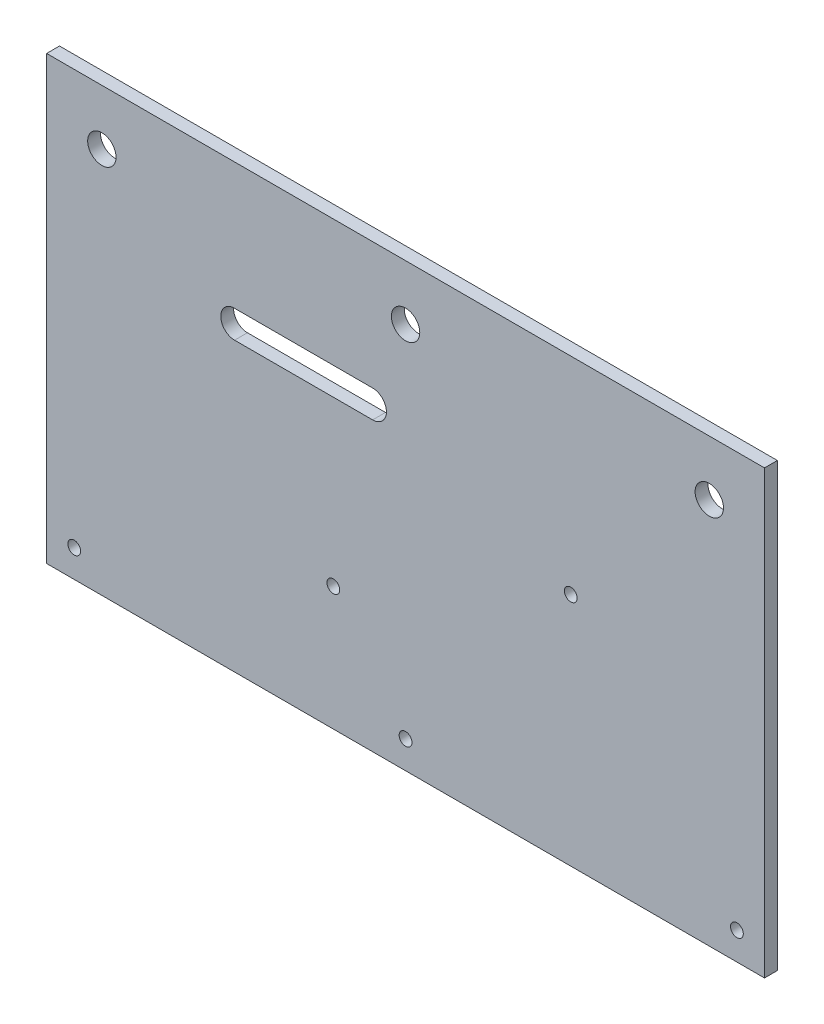
ISO-10303-21;
HEADER;
FILE_DESCRIPTION(('STEP AP214'),'2;1');
FILE_NAME('part.step','',(''),(''),'','','');
FILE_SCHEMA(('AUTOMOTIVE_DESIGN { 1 0 10303 214 1 1 1 1 }'));
ENDSEC;
DATA;
#1=APPLICATION_CONTEXT('core data for automotive mechanical design processes');
#2=APPLICATION_PROTOCOL_DEFINITION('international standard','automotive_design',2000,#1);
#3=PRODUCT_CONTEXT('',#1,'mechanical');
#4=PRODUCT('Part','Part','',(#3));
#5=PRODUCT_RELATED_PRODUCT_CATEGORY('part','',(#4));
#6=PRODUCT_DEFINITION_FORMATION('','',#4);
#7=PRODUCT_DEFINITION_CONTEXT('part definition',#1,'design');
#8=PRODUCT_DEFINITION('design','',#6,#7);
#9=PRODUCT_DEFINITION_SHAPE('','',#8);
#10=(LENGTH_UNIT() NAMED_UNIT(*) SI_UNIT(.MILLI.,.METRE.));
#11=(NAMED_UNIT(*) PLANE_ANGLE_UNIT() SI_UNIT($,.RADIAN.));
#12=(NAMED_UNIT(*) SI_UNIT($,.STERADIAN.) SOLID_ANGLE_UNIT());
#13=UNCERTAINTY_MEASURE_WITH_UNIT(LENGTH_MEASURE(1.E-05),#10,'distance_accuracy_value','');
#14=(GEOMETRIC_REPRESENTATION_CONTEXT(3) GLOBAL_UNCERTAINTY_ASSIGNED_CONTEXT((#13)) GLOBAL_UNIT_ASSIGNED_CONTEXT((#10,
#11,#12)) REPRESENTATION_CONTEXT('',''));
#15=CARTESIAN_POINT('',(0.,0.,0.));
#16=DIRECTION('',(0.,0.,1.));
#17=DIRECTION('',(1.,0.,0.));
#18=AXIS2_PLACEMENT_3D('',#15,#16,#17);
#19=CARTESIAN_POINT('',(0.,-50.8,1.47955));
#20=DIRECTION('',(0.,1.,0.));
#21=DIRECTION('',(0.,0.,1.));
#22=AXIS2_PLACEMENT_3D('',#19,#20,#21);
#23=PLANE('',#22);
#24=DIRECTION('',(1.,0.,0.));
#25=VECTOR('',#24,1.);
#26=CARTESIAN_POINT('',(0.,-50.8,-1.47955));
#27=LINE('',#26,#25);
#28=CARTESIAN_POINT('',(-82.55,-50.8,-1.47955));
#29=VERTEX_POINT('',#28);
#30=CARTESIAN_POINT('',(82.55,-50.8,-1.47955));
#31=VERTEX_POINT('',#30);
#32=EDGE_CURVE('E142',#29,#31,#27,.T.);
#33=ORIENTED_EDGE('',*,*,#32,.T.);
#34=DIRECTION('',(0.,0.,-1.));
#35=VECTOR('',#34,1.);
#36=CARTESIAN_POINT('',(82.55,-50.8,1.47955));
#37=LINE('',#36,#35);
#38=CARTESIAN_POINT('',(82.55,-50.8,1.47955));
#39=VERTEX_POINT('',#38);
#40=EDGE_CURVE('E11',#39,#31,#37,.T.);
#41=ORIENTED_EDGE('',*,*,#40,.F.);
#42=DIRECTION('',(1.,0.,0.));
#43=VECTOR('',#42,1.);
#44=CARTESIAN_POINT('',(0.,-50.8,1.47955));
#45=LINE('',#44,#43);
#46=CARTESIAN_POINT('',(-82.55,-50.8,1.47955));
#47=VERTEX_POINT('',#46);
#48=EDGE_CURVE('E112',#47,#39,#45,.T.);
#49=ORIENTED_EDGE('',*,*,#48,.F.);
#50=DIRECTION('',(0.,0.,-1.));
#51=VECTOR('',#50,1.);
#52=CARTESIAN_POINT('',(-82.55,-50.8,1.47955));
#53=LINE('',#52,#51);
#54=EDGE_CURVE('E52',#47,#29,#53,.T.);
#55=ORIENTED_EDGE('',*,*,#54,.T.);
#56=EDGE_LOOP('',(#33,#41,#49,#55));
#57=FACE_BOUND('',#56,.T.);
#58=ADVANCED_FACE('F33',(#57),#23,.F.);
#59=CARTESIAN_POINT('',(82.55,0.,1.47955));
#60=DIRECTION('',(-1.,0.,0.));
#61=DIRECTION('',(0.,0.,1.));
#62=AXIS2_PLACEMENT_3D('',#59,#60,#61);
#63=PLANE('',#62);
#64=DIRECTION('',(0.,1.,0.));
#65=VECTOR('',#64,1.);
#66=CARTESIAN_POINT('',(82.55,0.,-1.47955));
#67=LINE('',#66,#65);
#68=CARTESIAN_POINT('',(82.55,50.8,-1.47955));
#69=VERTEX_POINT('',#68);
#70=EDGE_CURVE('E118',#31,#69,#67,.T.);
#71=ORIENTED_EDGE('',*,*,#70,.T.);
#72=DIRECTION('',(0.,0.,-1.));
#73=VECTOR('',#72,1.);
#74=CARTESIAN_POINT('',(82.55,50.8,1.47955));
#75=LINE('',#74,#73);
#76=CARTESIAN_POINT('',(82.55,50.8,1.47955));
#77=VERTEX_POINT('',#76);
#78=EDGE_CURVE('E43',#77,#69,#75,.T.);
#79=ORIENTED_EDGE('',*,*,#78,.F.);
#80=DIRECTION('',(0.,1.,0.));
#81=VECTOR('',#80,1.);
#82=CARTESIAN_POINT('',(82.55,0.,1.47955));
#83=LINE('',#82,#81);
#84=EDGE_CURVE('E106',#39,#77,#83,.T.);
#85=ORIENTED_EDGE('',*,*,#84,.F.);
#86=ORIENTED_EDGE('',*,*,#40,.T.);
#87=EDGE_LOOP('',(#71,#79,#85,#86));
#88=FACE_BOUND('',#87,.T.);
#89=ADVANCED_FACE('F117',(#88),#63,.F.);
#90=CARTESIAN_POINT('',(0.,50.8,1.47955));
#91=DIRECTION('',(0.,1.,0.));
#92=DIRECTION('',(0.,0.,1.));
#93=AXIS2_PLACEMENT_3D('',#90,#91,#92);
#94=PLANE('',#93);
#95=DIRECTION('',(1.,0.,0.));
#96=VECTOR('',#95,1.);
#97=CARTESIAN_POINT('',(0.,50.8,-1.47955));
#98=LINE('',#97,#96);
#99=CARTESIAN_POINT('',(-82.55,50.8,-1.47955));
#100=VERTEX_POINT('',#99);
#101=EDGE_CURVE('E145',#100,#69,#98,.T.);
#102=ORIENTED_EDGE('',*,*,#101,.F.);
#103=DIRECTION('',(0.,0.,-1.));
#104=VECTOR('',#103,1.);
#105=CARTESIAN_POINT('',(-82.55,50.8,1.47955));
#106=LINE('',#105,#104);
#107=CARTESIAN_POINT('',(-82.55,50.8,1.47955));
#108=VERTEX_POINT('',#107);
#109=EDGE_CURVE('E78',#108,#100,#106,.T.);
#110=ORIENTED_EDGE('',*,*,#109,.F.);
#111=DIRECTION('',(1.,0.,0.));
#112=VECTOR('',#111,1.);
#113=CARTESIAN_POINT('',(0.,50.8,1.47955));
#114=LINE('',#113,#112);
#115=EDGE_CURVE('E111',#108,#77,#114,.T.);
#116=ORIENTED_EDGE('',*,*,#115,.T.);
#117=ORIENTED_EDGE('',*,*,#78,.T.);
#118=EDGE_LOOP('',(#102,#110,#116,#117));
#119=FACE_BOUND('',#118,.T.);
#120=ADVANCED_FACE('F122',(#119),#94,.T.);
#121=CARTESIAN_POINT('',(-7.57500000000001,18.475,1.47955));
#122=DIRECTION('',(0.,0.,-1.));
#123=DIRECTION('',(-1.,0.,0.));
#124=AXIS2_PLACEMENT_3D('',#121,#122,#123);
#125=CYLINDRICAL_SURFACE('',#124,3.175);
#126=CARTESIAN_POINT('',(-7.57500000000001,18.475,-1.47955));
#127=DIRECTION('',(0.,0.,1.));
#128=DIRECTION('',(1.,0.,0.));
#129=AXIS2_PLACEMENT_3D('',#126,#127,#128);
#130=CIRCLE('',#129,3.175);
#131=CARTESIAN_POINT('',(-7.57500000000001,15.3,-1.47955));
#132=VERTEX_POINT('',#131);
#133=CARTESIAN_POINT('',(-7.57500000000001,21.65,-1.47955));
#134=VERTEX_POINT('',#133);
#135=EDGE_CURVE('E129',#132,#134,#130,.T.);
#136=ORIENTED_EDGE('',*,*,#135,.F.);
#137=DIRECTION('',(0.,0.,-1.));
#138=VECTOR('',#137,1.);
#139=CARTESIAN_POINT('',(-7.57500000000001,15.3,1.47955));
#140=LINE('',#139,#138);
#141=CARTESIAN_POINT('',(-7.57500000000001,15.3,1.47955));
#142=VERTEX_POINT('',#141);
#143=EDGE_CURVE('E37',#142,#132,#140,.T.);
#144=ORIENTED_EDGE('',*,*,#143,.F.);
#145=CARTESIAN_POINT('',(-7.57500000000001,18.475,1.47955));
#146=DIRECTION('',(0.,0.,1.));
#147=DIRECTION('',(1.,0.,0.));
#148=AXIS2_PLACEMENT_3D('',#145,#146,#147);
#149=CIRCLE('',#148,3.175);
#150=CARTESIAN_POINT('',(-7.57500000000001,21.65,1.47955));
#151=VERTEX_POINT('',#150);
#152=EDGE_CURVE('E150',#142,#151,#149,.T.);
#153=ORIENTED_EDGE('',*,*,#152,.T.);
#154=DIRECTION('',(0.,0.,-1.));
#155=VECTOR('',#154,1.);
#156=CARTESIAN_POINT('',(-7.57500000000001,21.65,1.47955));
#157=LINE('',#156,#155);
#158=EDGE_CURVE('E125',#151,#134,#157,.T.);
#159=ORIENTED_EDGE('',*,*,#158,.T.);
#160=EDGE_LOOP('',(#136,#144,#153,#159));
#161=FACE_BOUND('',#160,.T.);
#162=ADVANCED_FACE('F35',(#161),#125,.F.);
#163=CARTESIAN_POINT('',(0.,15.3,1.47955));
#164=DIRECTION('',(0.,1.,0.));
#165=DIRECTION('',(-1.,0.,0.));
#166=AXIS2_PLACEMENT_3D('',#163,#164,#165);
#167=PLANE('',#166);
#168=DIRECTION('',(1.,0.,0.));
#169=VECTOR('',#168,1.);
#170=CARTESIAN_POINT('',(0.,15.3,-1.47955));
#171=LINE('',#170,#169);
#172=CARTESIAN_POINT('',(-39.325,15.3,-1.47955));
#173=VERTEX_POINT('',#172);
#174=EDGE_CURVE('E132',#173,#132,#171,.T.);
#175=ORIENTED_EDGE('',*,*,#174,.F.);
#176=DIRECTION('',(0.,0.,-1.));
#177=VECTOR('',#176,1.);
#178=CARTESIAN_POINT('',(-39.325,15.3,1.47955));
#179=LINE('',#178,#177);
#180=CARTESIAN_POINT('',(-39.325,15.3,1.47955));
#181=VERTEX_POINT('',#180);
#182=EDGE_CURVE('E155',#181,#173,#179,.T.);
#183=ORIENTED_EDGE('',*,*,#182,.F.);
#184=DIRECTION('',(1.,0.,0.));
#185=VECTOR('',#184,1.);
#186=CARTESIAN_POINT('',(0.,15.3,1.47955));
#187=LINE('',#186,#185);
#188=EDGE_CURVE('E164',#181,#142,#187,.T.);
#189=ORIENTED_EDGE('',*,*,#188,.T.);
#190=ORIENTED_EDGE('',*,*,#143,.T.);
#191=EDGE_LOOP('',(#175,#183,#189,#190));
#192=FACE_BOUND('',#191,.T.);
#193=ADVANCED_FACE('F162',(#192),#167,.T.);
#194=CARTESIAN_POINT('',(-39.325,18.475,1.47955));
#195=DIRECTION('',(0.,0.,-1.));
#196=DIRECTION('',(-1.,0.,0.));
#197=AXIS2_PLACEMENT_3D('',#194,#195,#196);
#198=CYLINDRICAL_SURFACE('',#197,3.17500000000001);
#199=CARTESIAN_POINT('',(-39.325,18.475,-1.47955));
#200=DIRECTION('',(0.,0.,1.));
#201=DIRECTION('',(1.,0.,0.));
#202=AXIS2_PLACEMENT_3D('',#199,#200,#201);
#203=CIRCLE('',#202,3.17500000000001);
#204=CARTESIAN_POINT('',(-39.325,21.65,-1.47955));
#205=VERTEX_POINT('',#204);
#206=EDGE_CURVE('E136',#205,#173,#203,.T.);
#207=ORIENTED_EDGE('',*,*,#206,.F.);
#208=DIRECTION('',(0.,0.,-1.));
#209=VECTOR('',#208,1.);
#210=CARTESIAN_POINT('',(-39.325,21.65,1.47955));
#211=LINE('',#210,#209);
#212=CARTESIAN_POINT('',(-39.325,21.65,1.47955));
#213=VERTEX_POINT('',#212);
#214=EDGE_CURVE('E154',#213,#205,#211,.T.);
#215=ORIENTED_EDGE('',*,*,#214,.F.);
#216=CARTESIAN_POINT('',(-39.325,18.475,1.47955));
#217=DIRECTION('',(0.,0.,1.));
#218=DIRECTION('',(1.,0.,0.));
#219=AXIS2_PLACEMENT_3D('',#216,#217,#218);
#220=CIRCLE('',#219,3.17500000000001);
#221=EDGE_CURVE('E173',#213,#181,#220,.T.);
#222=ORIENTED_EDGE('',*,*,#221,.T.);
#223=ORIENTED_EDGE('',*,*,#182,.T.);
#224=EDGE_LOOP('',(#207,#215,#222,#223));
#225=FACE_BOUND('',#224,.T.);
#226=ADVANCED_FACE('F170',(#225),#198,.F.);
#227=CARTESIAN_POINT('',(0.,21.65,1.47955));
#228=DIRECTION('',(0.,1.,0.));
#229=DIRECTION('',(-1.,0.,0.));
#230=AXIS2_PLACEMENT_3D('',#227,#228,#229);
#231=PLANE('',#230);
#232=DIRECTION('',(1.,0.,0.));
#233=VECTOR('',#232,1.);
#234=CARTESIAN_POINT('',(0.,21.65,-1.47955));
#235=LINE('',#234,#233);
#236=EDGE_CURVE('E139',#205,#134,#235,.T.);
#237=ORIENTED_EDGE('',*,*,#236,.T.);
#238=ORIENTED_EDGE('',*,*,#158,.F.);
#239=DIRECTION('',(1.,0.,0.));
#240=VECTOR('',#239,1.);
#241=CARTESIAN_POINT('',(0.,21.65,1.47955));
#242=LINE('',#241,#240);
#243=EDGE_CURVE('E175',#213,#151,#242,.T.);
#244=ORIENTED_EDGE('',*,*,#243,.F.);
#245=ORIENTED_EDGE('',*,*,#214,.T.);
#246=EDGE_LOOP('',(#237,#238,#244,#245));
#247=FACE_BOUND('',#246,.T.);
#248=ADVANCED_FACE('F176',(#247),#231,.F.);
#249=CARTESIAN_POINT('',(-82.55,0.,1.47955));
#250=DIRECTION('',(-1.,0.,0.));
#251=DIRECTION('',(0.,0.,1.));
#252=AXIS2_PLACEMENT_3D('',#249,#250,#251);
#253=PLANE('',#252);
#254=DIRECTION('',(0.,1.,0.));
#255=VECTOR('',#254,1.);
#256=CARTESIAN_POINT('',(-82.55,0.,-1.47955));
#257=LINE('',#256,#255);
#258=EDGE_CURVE('E147',#29,#100,#257,.T.);
#259=ORIENTED_EDGE('',*,*,#258,.F.);
#260=ORIENTED_EDGE('',*,*,#54,.F.);
#261=DIRECTION('',(0.,1.,0.));
#262=VECTOR('',#261,1.);
#263=CARTESIAN_POINT('',(-82.55,0.,1.47955));
#264=LINE('',#263,#262);
#265=EDGE_CURVE('E123',#47,#108,#264,.T.);
#266=ORIENTED_EDGE('',*,*,#265,.T.);
#267=ORIENTED_EDGE('',*,*,#109,.T.);
#268=EDGE_LOOP('',(#259,#260,#266,#267));
#269=FACE_BOUND('',#268,.T.);
#270=ADVANCED_FACE('F235',(#269),#253,.T.);
#271=CARTESIAN_POINT('',(0.,0.,1.47955));
#272=DIRECTION('',(0.,0.,1.));
#273=DIRECTION('',(1.,0.,0.));
#274=AXIS2_PLACEMENT_3D('',#271,#272,#273);
#275=PLANE('',#274);
#276=CARTESIAN_POINT('',(38.,3.30000000000001,1.47955));
#277=DIRECTION('',(0.,0.,1.));
#278=DIRECTION('',(1.,0.,0.));
#279=AXIS2_PLACEMENT_3D('',#276,#277,#278);
#280=CIRCLE('',#279,1.47319999999999);
#281=CARTESIAN_POINT('',(39.4732,3.30000000000001,1.47955));
#282=VERTEX_POINT('',#281);
#283=EDGE_CURVE('E227',#282,#282,#280,.T.);
#284=ORIENTED_EDGE('',*,*,#283,.F.);
#285=EDGE_LOOP('',(#284));
#286=FACE_BOUND('',#285,.T.);
#287=CARTESIAN_POINT('',(-16.61,-22.354,1.47955));
#288=DIRECTION('',(0.,0.,1.));
#289=DIRECTION('',(1.,0.,0.));
#290=AXIS2_PLACEMENT_3D('',#287,#288,#289);
#291=CIRCLE('',#290,1.47319999999999);
#292=CARTESIAN_POINT('',(-15.1368,-22.354,1.47955));
#293=VERTEX_POINT('',#292);
#294=EDGE_CURVE('E221',#293,#293,#291,.T.);
#295=ORIENTED_EDGE('',*,*,#294,.F.);
#296=EDGE_LOOP('',(#295));
#297=FACE_BOUND('',#296,.T.);
#298=CARTESIAN_POINT('',(-76.2,-44.45,1.47955));
#299=DIRECTION('',(0.,0.,1.));
#300=DIRECTION('',(1.,0.,0.));
#301=AXIS2_PLACEMENT_3D('',#298,#299,#300);
#302=CIRCLE('',#301,1.47319999999999);
#303=CARTESIAN_POINT('',(-74.7268,-44.45,1.47955));
#304=VERTEX_POINT('',#303);
#305=EDGE_CURVE('E215',#304,#304,#302,.T.);
#306=ORIENTED_EDGE('',*,*,#305,.F.);
#307=EDGE_LOOP('',(#306));
#308=FACE_BOUND('',#307,.T.);
#309=CARTESIAN_POINT('',(76.2,-44.45,1.47955));
#310=DIRECTION('',(0.,0.,1.));
#311=DIRECTION('',(1.,0.,0.));
#312=AXIS2_PLACEMENT_3D('',#309,#310,#311);
#313=CIRCLE('',#312,1.47319999999998);
#314=CARTESIAN_POINT('',(77.6731999999999,-44.45,1.47955));
#315=VERTEX_POINT('',#314);
#316=EDGE_CURVE('E209',#315,#315,#313,.T.);
#317=ORIENTED_EDGE('',*,*,#316,.F.);
#318=EDGE_LOOP('',(#317));
#319=FACE_BOUND('',#318,.T.);
#320=CARTESIAN_POINT('',(0.,-44.45,1.47955));
#321=DIRECTION('',(0.,0.,1.));
#322=DIRECTION('',(1.,0.,0.));
#323=AXIS2_PLACEMENT_3D('',#320,#321,#322);
#324=CIRCLE('',#323,1.47319999999999);
#325=CARTESIAN_POINT('',(1.47319999999999,-44.45,1.47955));
#326=VERTEX_POINT('',#325);
#327=EDGE_CURVE('E203',#326,#326,#324,.T.);
#328=ORIENTED_EDGE('',*,*,#327,.F.);
#329=EDGE_LOOP('',(#328));
#330=FACE_BOUND('',#329,.T.);
#331=CARTESIAN_POINT('',(-69.85,38.1,1.47955));
#332=DIRECTION('',(0.,0.,1.));
#333=DIRECTION('',(1.,0.,0.));
#334=AXIS2_PLACEMENT_3D('',#331,#332,#333);
#335=CIRCLE('',#334,3.26389999999999);
#336=CARTESIAN_POINT('',(-66.5861,38.1,1.47955));
#337=VERTEX_POINT('',#336);
#338=EDGE_CURVE('E197',#337,#337,#335,.T.);
#339=ORIENTED_EDGE('',*,*,#338,.F.);
#340=EDGE_LOOP('',(#339));
#341=FACE_BOUND('',#340,.T.);
#342=CARTESIAN_POINT('',(69.8499999999999,38.1,1.47955));
#343=DIRECTION('',(0.,0.,1.));
#344=DIRECTION('',(1.,0.,0.));
#345=AXIS2_PLACEMENT_3D('',#342,#343,#344);
#346=CIRCLE('',#345,3.26389999999999);
#347=CARTESIAN_POINT('',(73.1138999999999,38.1,1.47955));
#348=VERTEX_POINT('',#347);
#349=EDGE_CURVE('E191',#348,#348,#346,.T.);
#350=ORIENTED_EDGE('',*,*,#349,.F.);
#351=EDGE_LOOP('',(#350));
#352=FACE_BOUND('',#351,.T.);
#353=CARTESIAN_POINT('',(0.,38.1,1.47955));
#354=DIRECTION('',(0.,0.,1.));
#355=DIRECTION('',(1.,0.,0.));
#356=AXIS2_PLACEMENT_3D('',#353,#354,#355);
#357=CIRCLE('',#356,3.26389999999999);
#358=CARTESIAN_POINT('',(3.26389999999999,38.1,1.47955));
#359=VERTEX_POINT('',#358);
#360=EDGE_CURVE('E185',#359,#359,#357,.T.);
#361=ORIENTED_EDGE('',*,*,#360,.F.);
#362=EDGE_LOOP('',(#361));
#363=FACE_BOUND('',#362,.T.);
#364=ORIENTED_EDGE('',*,*,#152,.F.);
#365=ORIENTED_EDGE('',*,*,#188,.F.);
#366=ORIENTED_EDGE('',*,*,#221,.F.);
#367=ORIENTED_EDGE('',*,*,#243,.T.);
#368=EDGE_LOOP('',(#364,#365,#366,#367));
#369=FACE_BOUND('',#368,.T.);
#370=ORIENTED_EDGE('',*,*,#48,.T.);
#371=ORIENTED_EDGE('',*,*,#84,.T.);
#372=ORIENTED_EDGE('',*,*,#115,.F.);
#373=ORIENTED_EDGE('',*,*,#265,.F.);
#374=EDGE_LOOP('',(#370,#371,#372,#373));
#375=FACE_BOUND('',#374,.T.);
#376=ADVANCED_FACE('F108',(#286,#297,#308,#319,#330,#341,#352,#363,#369,#375),#275,.T.);
#377=CARTESIAN_POINT('',(0.,0.,-1.47955));
#378=DIRECTION('',(0.,0.,1.));
#379=DIRECTION('',(1.,0.,0.));
#380=AXIS2_PLACEMENT_3D('',#377,#378,#379);
#381=PLANE('',#380);
#382=CARTESIAN_POINT('',(38.,3.30000000000001,-1.47955));
#383=DIRECTION('',(0.,0.,1.));
#384=DIRECTION('',(1.,0.,0.));
#385=AXIS2_PLACEMENT_3D('',#382,#383,#384);
#386=CIRCLE('',#385,1.4732);
#387=CARTESIAN_POINT('',(39.4732,3.30000000000001,-1.47955));
#388=VERTEX_POINT('',#387);
#389=EDGE_CURVE('E224',#388,#388,#386,.T.);
#390=ORIENTED_EDGE('',*,*,#389,.T.);
#391=EDGE_LOOP('',(#390));
#392=FACE_BOUND('',#391,.T.);
#393=CARTESIAN_POINT('',(-16.61,-22.354,-1.47955));
#394=DIRECTION('',(0.,0.,1.));
#395=DIRECTION('',(1.,0.,0.));
#396=AXIS2_PLACEMENT_3D('',#393,#394,#395);
#397=CIRCLE('',#396,1.4732);
#398=CARTESIAN_POINT('',(-15.1368,-22.354,-1.47955));
#399=VERTEX_POINT('',#398);
#400=EDGE_CURVE('E218',#399,#399,#397,.T.);
#401=ORIENTED_EDGE('',*,*,#400,.T.);
#402=EDGE_LOOP('',(#401));
#403=FACE_BOUND('',#402,.T.);
#404=CARTESIAN_POINT('',(-76.2,-44.45,-1.47955));
#405=DIRECTION('',(0.,0.,1.));
#406=DIRECTION('',(1.,0.,0.));
#407=AXIS2_PLACEMENT_3D('',#404,#405,#406);
#408=CIRCLE('',#407,1.47319999999999);
#409=CARTESIAN_POINT('',(-74.7268,-44.45,-1.47955));
#410=VERTEX_POINT('',#409);
#411=EDGE_CURVE('E212',#410,#410,#408,.T.);
#412=ORIENTED_EDGE('',*,*,#411,.T.);
#413=EDGE_LOOP('',(#412));
#414=FACE_BOUND('',#413,.T.);
#415=CARTESIAN_POINT('',(76.2,-44.45,-1.47955));
#416=DIRECTION('',(0.,0.,1.));
#417=DIRECTION('',(1.,0.,0.));
#418=AXIS2_PLACEMENT_3D('',#415,#416,#417);
#419=CIRCLE('',#418,1.47319999999999);
#420=CARTESIAN_POINT('',(77.6732,-44.45,-1.47955));
#421=VERTEX_POINT('',#420);
#422=EDGE_CURVE('E206',#421,#421,#419,.T.);
#423=ORIENTED_EDGE('',*,*,#422,.T.);
#424=EDGE_LOOP('',(#423));
#425=FACE_BOUND('',#424,.T.);
#426=CARTESIAN_POINT('',(0.,-44.45,-1.47955));
#427=DIRECTION('',(0.,0.,1.));
#428=DIRECTION('',(1.,0.,0.));
#429=AXIS2_PLACEMENT_3D('',#426,#427,#428);
#430=CIRCLE('',#429,1.4732);
#431=CARTESIAN_POINT('',(1.4732,-44.45,-1.47955));
#432=VERTEX_POINT('',#431);
#433=EDGE_CURVE('E200',#432,#432,#430,.T.);
#434=ORIENTED_EDGE('',*,*,#433,.T.);
#435=EDGE_LOOP('',(#434));
#436=FACE_BOUND('',#435,.T.);
#437=CARTESIAN_POINT('',(-69.85,38.1,-1.47955));
#438=DIRECTION('',(0.,0.,1.));
#439=DIRECTION('',(1.,0.,0.));
#440=AXIS2_PLACEMENT_3D('',#437,#438,#439);
#441=CIRCLE('',#440,3.2639);
#442=CARTESIAN_POINT('',(-66.5861,38.1,-1.47955));
#443=VERTEX_POINT('',#442);
#444=EDGE_CURVE('E194',#443,#443,#441,.T.);
#445=ORIENTED_EDGE('',*,*,#444,.T.);
#446=EDGE_LOOP('',(#445));
#447=FACE_BOUND('',#446,.T.);
#448=CARTESIAN_POINT('',(69.8499999999999,38.1,-1.47955));
#449=DIRECTION('',(0.,0.,1.));
#450=DIRECTION('',(1.,0.,0.));
#451=AXIS2_PLACEMENT_3D('',#448,#449,#450);
#452=CIRCLE('',#451,3.2639);
#453=CARTESIAN_POINT('',(73.1138999999999,38.1,-1.47955));
#454=VERTEX_POINT('',#453);
#455=EDGE_CURVE('E188',#454,#454,#452,.T.);
#456=ORIENTED_EDGE('',*,*,#455,.T.);
#457=EDGE_LOOP('',(#456));
#458=FACE_BOUND('',#457,.T.);
#459=CARTESIAN_POINT('',(0.,38.1,-1.47955));
#460=DIRECTION('',(0.,0.,1.));
#461=DIRECTION('',(1.,0.,0.));
#462=AXIS2_PLACEMENT_3D('',#459,#460,#461);
#463=CIRCLE('',#462,3.2639);
#464=CARTESIAN_POINT('',(3.2639,38.1,-1.47955));
#465=VERTEX_POINT('',#464);
#466=EDGE_CURVE('E133',#465,#465,#463,.T.);
#467=ORIENTED_EDGE('',*,*,#466,.T.);
#468=EDGE_LOOP('',(#467));
#469=FACE_BOUND('',#468,.T.);
#470=ORIENTED_EDGE('',*,*,#135,.T.);
#471=ORIENTED_EDGE('',*,*,#236,.F.);
#472=ORIENTED_EDGE('',*,*,#206,.T.);
#473=ORIENTED_EDGE('',*,*,#174,.T.);
#474=EDGE_LOOP('',(#470,#471,#472,#473));
#475=FACE_BOUND('',#474,.T.);
#476=ORIENTED_EDGE('',*,*,#32,.F.);
#477=ORIENTED_EDGE('',*,*,#258,.T.);
#478=ORIENTED_EDGE('',*,*,#101,.T.);
#479=ORIENTED_EDGE('',*,*,#70,.F.);
#480=EDGE_LOOP('',(#476,#477,#478,#479));
#481=FACE_BOUND('',#480,.T.);
#482=ADVANCED_FACE('F168',(#392,#403,#414,#425,#436,#447,#458,#469,#475,#481),#381,.F.);
#483=CARTESIAN_POINT('',(0.,38.1,1.47955));
#484=DIRECTION('',(0.,0.,1.));
#485=DIRECTION('',(1.,0.,0.));
#486=AXIS2_PLACEMENT_3D('',#483,#484,#485);
#487=CYLINDRICAL_SURFACE('',#486,3.26389999999999);
#488=ORIENTED_EDGE('',*,*,#466,.F.);
#489=EDGE_LOOP('',(#488));
#490=FACE_BOUND('',#489,.T.);
#491=ORIENTED_EDGE('',*,*,#360,.T.);
#492=EDGE_LOOP('',(#491));
#493=FACE_BOUND('',#492,.T.);
#494=ADVANCED_FACE('F251',(#490,#493),#487,.F.);
#495=CARTESIAN_POINT('',(69.8499999999999,38.1,1.47955));
#496=DIRECTION('',(0.,0.,1.));
#497=DIRECTION('',(1.,0.,0.));
#498=AXIS2_PLACEMENT_3D('',#495,#496,#497);
#499=CYLINDRICAL_SURFACE('',#498,3.26389999999999);
#500=ORIENTED_EDGE('',*,*,#455,.F.);
#501=EDGE_LOOP('',(#500));
#502=FACE_BOUND('',#501,.T.);
#503=ORIENTED_EDGE('',*,*,#349,.T.);
#504=EDGE_LOOP('',(#503));
#505=FACE_BOUND('',#504,.T.);
#506=ADVANCED_FACE('F253',(#502,#505),#499,.F.);
#507=CARTESIAN_POINT('',(-69.85,38.1,1.47955));
#508=DIRECTION('',(0.,0.,1.));
#509=DIRECTION('',(1.,0.,0.));
#510=AXIS2_PLACEMENT_3D('',#507,#508,#509);
#511=CYLINDRICAL_SURFACE('',#510,3.26389999999999);
#512=ORIENTED_EDGE('',*,*,#444,.F.);
#513=EDGE_LOOP('',(#512));
#514=FACE_BOUND('',#513,.T.);
#515=ORIENTED_EDGE('',*,*,#338,.T.);
#516=EDGE_LOOP('',(#515));
#517=FACE_BOUND('',#516,.T.);
#518=ADVANCED_FACE('F260',(#514,#517),#511,.F.);
#519=CARTESIAN_POINT('',(0.,-44.45,1.47955));
#520=DIRECTION('',(0.,0.,1.));
#521=DIRECTION('',(1.,0.,0.));
#522=AXIS2_PLACEMENT_3D('',#519,#520,#521);
#523=CYLINDRICAL_SURFACE('',#522,1.47319999999999);
#524=ORIENTED_EDGE('',*,*,#433,.F.);
#525=EDGE_LOOP('',(#524));
#526=FACE_BOUND('',#525,.T.);
#527=ORIENTED_EDGE('',*,*,#327,.T.);
#528=EDGE_LOOP('',(#527));
#529=FACE_BOUND('',#528,.T.);
#530=ADVANCED_FACE('F307',(#526,#529),#523,.F.);
#531=CARTESIAN_POINT('',(76.2,-44.45,1.47955));
#532=DIRECTION('',(0.,0.,1.));
#533=DIRECTION('',(1.,0.,0.));
#534=AXIS2_PLACEMENT_3D('',#531,#532,#533);
#535=CYLINDRICAL_SURFACE('',#534,1.47319999999999);
#536=ORIENTED_EDGE('',*,*,#422,.F.);
#537=EDGE_LOOP('',(#536));
#538=FACE_BOUND('',#537,.T.);
#539=ORIENTED_EDGE('',*,*,#316,.T.);
#540=EDGE_LOOP('',(#539));
#541=FACE_BOUND('',#540,.T.);
#542=ADVANCED_FACE('F312',(#538,#541),#535,.F.);
#543=CARTESIAN_POINT('',(-76.2,-44.45,1.47955));
#544=DIRECTION('',(0.,0.,1.));
#545=DIRECTION('',(1.,0.,0.));
#546=AXIS2_PLACEMENT_3D('',#543,#544,#545);
#547=CYLINDRICAL_SURFACE('',#546,1.47319999999999);
#548=ORIENTED_EDGE('',*,*,#411,.F.);
#549=EDGE_LOOP('',(#548));
#550=FACE_BOUND('',#549,.T.);
#551=ORIENTED_EDGE('',*,*,#305,.T.);
#552=EDGE_LOOP('',(#551));
#553=FACE_BOUND('',#552,.T.);
#554=ADVANCED_FACE('F324',(#550,#553),#547,.F.);
#555=CARTESIAN_POINT('',(-16.61,-22.354,1.47955));
#556=DIRECTION('',(0.,0.,1.));
#557=DIRECTION('',(1.,0.,0.));
#558=AXIS2_PLACEMENT_3D('',#555,#556,#557);
#559=CYLINDRICAL_SURFACE('',#558,1.47319999999999);
#560=ORIENTED_EDGE('',*,*,#400,.F.);
#561=EDGE_LOOP('',(#560));
#562=FACE_BOUND('',#561,.T.);
#563=ORIENTED_EDGE('',*,*,#294,.T.);
#564=EDGE_LOOP('',(#563));
#565=FACE_BOUND('',#564,.T.);
#566=ADVANCED_FACE('F334',(#562,#565),#559,.F.);
#567=CARTESIAN_POINT('',(38.,3.30000000000001,1.47955));
#568=DIRECTION('',(0.,0.,1.));
#569=DIRECTION('',(1.,0.,0.));
#570=AXIS2_PLACEMENT_3D('',#567,#568,#569);
#571=CYLINDRICAL_SURFACE('',#570,1.47319999999999);
#572=ORIENTED_EDGE('',*,*,#389,.F.);
#573=EDGE_LOOP('',(#572));
#574=FACE_BOUND('',#573,.T.);
#575=ORIENTED_EDGE('',*,*,#283,.T.);
#576=EDGE_LOOP('',(#575));
#577=FACE_BOUND('',#576,.T.);
#578=ADVANCED_FACE('F231',(#574,#577),#571,.F.);
#579=CLOSED_SHELL('',(#58,#89,#120,#162,#193,#226,#248,#270,#376,#482,#494,#506,#518,#530,#542,
#554,#566,#578));
#580=MANIFOLD_SOLID_BREP('B2',#579);
#581=ADVANCED_BREP_SHAPE_REPRESENTATION('',(#18,#580),#14);
#582=SHAPE_DEFINITION_REPRESENTATION(#9,#581);
ENDSEC;
END-ISO-10303-21;
